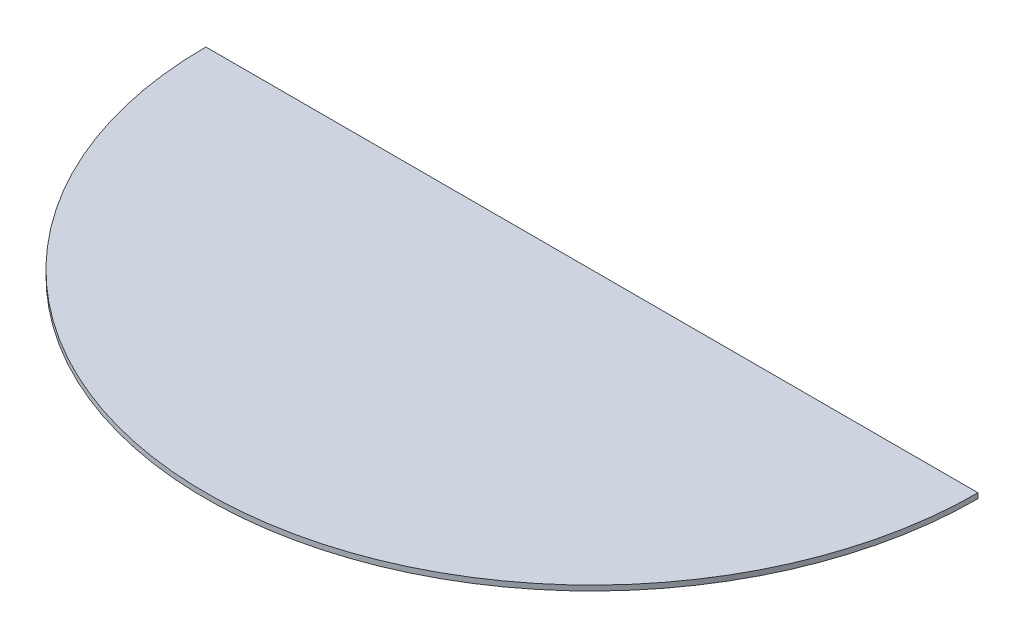
ISO-10303-21;
HEADER;
FILE_DESCRIPTION(('STEP AP214'),'2;1');
FILE_NAME('part.step','',(''),(''),'','','');
FILE_SCHEMA(('AUTOMOTIVE_DESIGN { 1 0 10303 214 1 1 1 1 }'));
ENDSEC;
DATA;
#1=APPLICATION_CONTEXT('core data for automotive mechanical design processes');
#2=APPLICATION_PROTOCOL_DEFINITION('international standard','automotive_design',2000,#1);
#3=PRODUCT_CONTEXT('',#1,'mechanical');
#4=PRODUCT('Part','Part','',(#3));
#5=PRODUCT_RELATED_PRODUCT_CATEGORY('part','',(#4));
#6=PRODUCT_DEFINITION_FORMATION('','',#4);
#7=PRODUCT_DEFINITION_CONTEXT('part definition',#1,'design');
#8=PRODUCT_DEFINITION('design','',#6,#7);
#9=PRODUCT_DEFINITION_SHAPE('','',#8);
#10=(LENGTH_UNIT() NAMED_UNIT(*) SI_UNIT(.MILLI.,.METRE.));
#11=(NAMED_UNIT(*) PLANE_ANGLE_UNIT() SI_UNIT($,.RADIAN.));
#12=(NAMED_UNIT(*) SI_UNIT($,.STERADIAN.) SOLID_ANGLE_UNIT());
#13=UNCERTAINTY_MEASURE_WITH_UNIT(LENGTH_MEASURE(1.E-05),#10,'distance_accuracy_value','');
#14=(GEOMETRIC_REPRESENTATION_CONTEXT(3) GLOBAL_UNCERTAINTY_ASSIGNED_CONTEXT((#13)) GLOBAL_UNIT_ASSIGNED_CONTEXT((#10,
#11,#12)) REPRESENTATION_CONTEXT('',''));
#15=CARTESIAN_POINT('',(0.,0.,0.));
#16=DIRECTION('',(0.,0.,1.));
#17=DIRECTION('',(1.,0.,0.));
#18=AXIS2_PLACEMENT_3D('',#15,#16,#17);
#19=CARTESIAN_POINT('',(0.,1.,0.));
#20=DIRECTION('',(0.,-1.,0.));
#21=DIRECTION('',(0.,0.,-1.));
#22=AXIS2_PLACEMENT_3D('',#19,#20,#21);
#23=CYLINDRICAL_SURFACE('',#22,75.);
#24=CARTESIAN_POINT('',(0.,0.,0.));
#25=DIRECTION('',(0.,1.,0.));
#26=DIRECTION('',(0.,0.,1.));
#27=AXIS2_PLACEMENT_3D('',#24,#25,#26);
#28=CIRCLE('',#27,75.);
#29=CARTESIAN_POINT('',(-75.,0.,0.));
#30=VERTEX_POINT('',#29);
#31=CARTESIAN_POINT('',(75.,0.,0.));
#32=VERTEX_POINT('',#31);
#33=EDGE_CURVE('E63',#30,#32,#28,.T.);
#34=ORIENTED_EDGE('',*,*,#33,.T.);
#35=DIRECTION('',(0.,-1.,0.));
#36=VECTOR('',#35,1.);
#37=CARTESIAN_POINT('',(75.,1.,0.));
#38=LINE('',#37,#36);
#39=CARTESIAN_POINT('',(75.,1.,0.));
#40=VERTEX_POINT('',#39);
#41=EDGE_CURVE('E11',#40,#32,#38,.T.);
#42=ORIENTED_EDGE('',*,*,#41,.F.);
#43=CARTESIAN_POINT('',(0.,1.,0.));
#44=DIRECTION('',(0.,1.,0.));
#45=DIRECTION('',(0.,0.,1.));
#46=AXIS2_PLACEMENT_3D('',#43,#44,#45);
#47=CIRCLE('',#46,75.);
#48=CARTESIAN_POINT('',(-75.,1.,0.));
#49=VERTEX_POINT('',#48);
#50=EDGE_CURVE('E62',#49,#40,#47,.T.);
#51=ORIENTED_EDGE('',*,*,#50,.F.);
#52=DIRECTION('',(0.,-1.,0.));
#53=VECTOR('',#52,1.);
#54=CARTESIAN_POINT('',(-75.,1.,0.));
#55=LINE('',#54,#53);
#56=EDGE_CURVE('E40',#49,#30,#55,.T.);
#57=ORIENTED_EDGE('',*,*,#56,.T.);
#58=EDGE_LOOP('',(#34,#42,#51,#57));
#59=FACE_BOUND('',#58,.T.);
#60=ADVANCED_FACE('F32',(#59),#23,.T.);
#61=CARTESIAN_POINT('',(-75.,1.,0.));
#62=DIRECTION('',(0.,0.,1.));
#63=DIRECTION('',(1.,0.,0.));
#64=AXIS2_PLACEMENT_3D('',#61,#62,#63);
#65=PLANE('',#64);
#66=DIRECTION('',(-1.,0.,0.));
#67=VECTOR('',#66,1.);
#68=CARTESIAN_POINT('',(-75.,0.,0.));
#69=LINE('',#68,#67);
#70=EDGE_CURVE('E55',#32,#30,#69,.T.);
#71=ORIENTED_EDGE('',*,*,#70,.T.);
#72=ORIENTED_EDGE('',*,*,#56,.F.);
#73=DIRECTION('',(-1.,0.,0.));
#74=VECTOR('',#73,1.);
#75=CARTESIAN_POINT('',(-75.,1.,0.));
#76=LINE('',#75,#74);
#77=EDGE_CURVE('E47',#40,#49,#76,.T.);
#78=ORIENTED_EDGE('',*,*,#77,.F.);
#79=ORIENTED_EDGE('',*,*,#41,.T.);
#80=EDGE_LOOP('',(#71,#72,#78,#79));
#81=FACE_BOUND('',#80,.T.);
#82=ADVANCED_FACE('F58',(#81),#65,.F.);
#83=CARTESIAN_POINT('',(0.,1.,0.));
#84=DIRECTION('',(0.,1.,0.));
#85=DIRECTION('',(0.,0.,1.));
#86=AXIS2_PLACEMENT_3D('',#83,#84,#85);
#87=PLANE('',#86);
#88=ORIENTED_EDGE('',*,*,#50,.T.);
#89=ORIENTED_EDGE('',*,*,#77,.T.);
#90=EDGE_LOOP('',(#88,#89));
#91=FACE_BOUND('',#90,.T.);
#92=ADVANCED_FACE('F70',(#91),#87,.T.);
#93=CARTESIAN_POINT('',(0.,0.,0.));
#94=DIRECTION('',(0.,1.,0.));
#95=DIRECTION('',(0.,0.,1.));
#96=AXIS2_PLACEMENT_3D('',#93,#94,#95);
#97=PLANE('',#96);
#98=ORIENTED_EDGE('',*,*,#33,.F.);
#99=ORIENTED_EDGE('',*,*,#70,.F.);
#100=EDGE_LOOP('',(#98,#99));
#101=FACE_BOUND('',#100,.T.);
#102=ADVANCED_FACE('F66',(#101),#97,.F.);
#103=CLOSED_SHELL('',(#60,#82,#92,#102));
#104=MANIFOLD_SOLID_BREP('B2',#103);
#105=ADVANCED_BREP_SHAPE_REPRESENTATION('',(#18,#104),#14);
#106=SHAPE_DEFINITION_REPRESENTATION(#9,#105);
ENDSEC;
END-ISO-10303-21;
